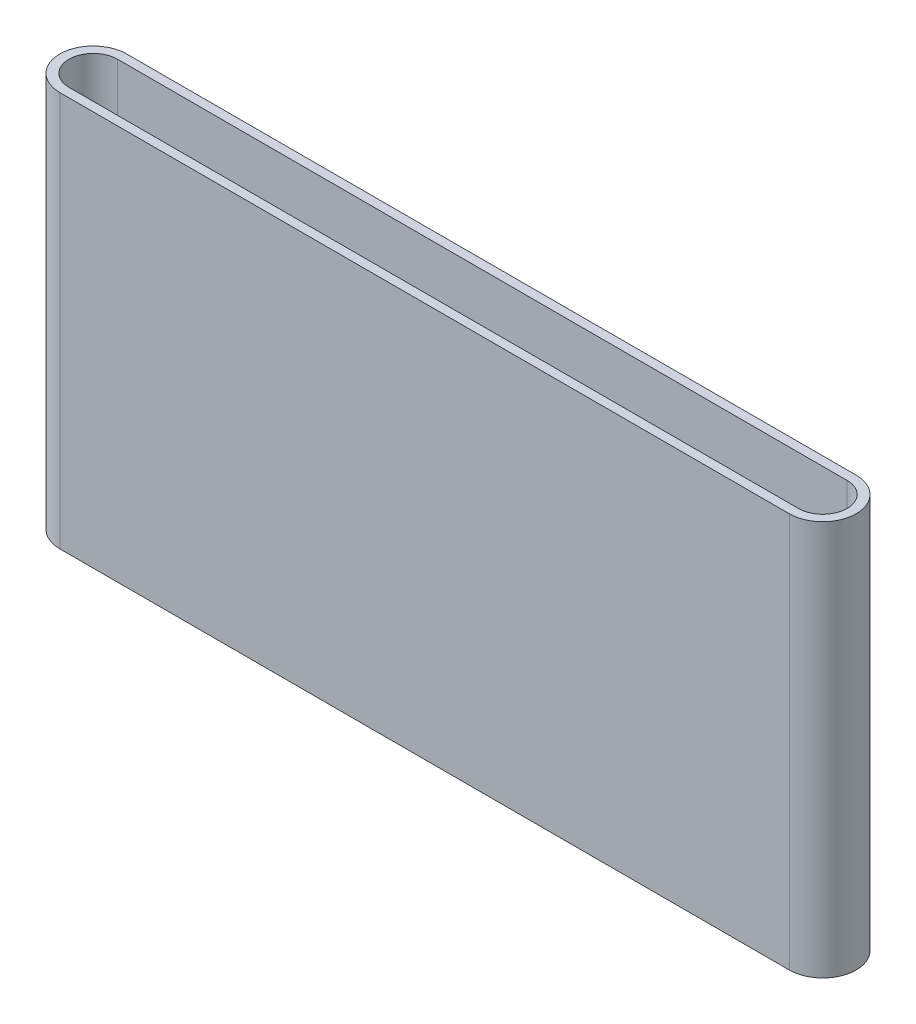
ISO-10303-21;
HEADER;
FILE_DESCRIPTION(('STEP AP214'),'2;1');
FILE_NAME('part.step','',(''),(''),'','','');
FILE_SCHEMA(('AUTOMOTIVE_DESIGN { 1 0 10303 214 1 1 1 1 }'));
ENDSEC;
DATA;
#1=APPLICATION_CONTEXT('core data for automotive mechanical design processes');
#2=APPLICATION_PROTOCOL_DEFINITION('international standard','automotive_design',2000,#1);
#3=PRODUCT_CONTEXT('',#1,'mechanical');
#4=PRODUCT('Part','Part','',(#3));
#5=PRODUCT_RELATED_PRODUCT_CATEGORY('part','',(#4));
#6=PRODUCT_DEFINITION_FORMATION('','',#4);
#7=PRODUCT_DEFINITION_CONTEXT('part definition',#1,'design');
#8=PRODUCT_DEFINITION('design','',#6,#7);
#9=PRODUCT_DEFINITION_SHAPE('','',#8);
#10=(LENGTH_UNIT() NAMED_UNIT(*) SI_UNIT(.MILLI.,.METRE.));
#11=(NAMED_UNIT(*) PLANE_ANGLE_UNIT() SI_UNIT($,.RADIAN.));
#12=(NAMED_UNIT(*) SI_UNIT($,.STERADIAN.) SOLID_ANGLE_UNIT());
#13=UNCERTAINTY_MEASURE_WITH_UNIT(LENGTH_MEASURE(1.E-05),#10,'distance_accuracy_value','');
#14=(GEOMETRIC_REPRESENTATION_CONTEXT(3) GLOBAL_UNCERTAINTY_ASSIGNED_CONTEXT((#13)) GLOBAL_UNIT_ASSIGNED_CONTEXT((#10,
#11,#12)) REPRESENTATION_CONTEXT('',''));
#15=CARTESIAN_POINT('',(0.,0.,0.));
#16=DIRECTION('',(0.,0.,1.));
#17=DIRECTION('',(1.,0.,0.));
#18=AXIS2_PLACEMENT_3D('',#15,#16,#17);
#19=CARTESIAN_POINT('',(0.,65.,0.));
#20=DIRECTION('',(0.,1.,0.));
#21=DIRECTION('',(0.,0.,1.));
#22=AXIS2_PLACEMENT_3D('',#19,#20,#21);
#23=PLANE('',#22);
#24=CARTESIAN_POINT('',(0.,65.,0.));
#25=DIRECTION('',(0.,1.,0.));
#26=DIRECTION('',(0.,0.,1.));
#27=AXIS2_PLACEMENT_3D('',#24,#25,#26);
#28=CIRCLE('',#27,5.5);
#29=CARTESIAN_POINT('',(0.,65.,-5.5));
#30=VERTEX_POINT('',#29);
#31=CARTESIAN_POINT('',(0.,65.,5.5));
#32=VERTEX_POINT('',#31);
#33=EDGE_CURVE('E143',#30,#32,#28,.T.);
#34=ORIENTED_EDGE('',*,*,#33,.T.);
#35=DIRECTION('',(1.,0.,0.));
#36=VECTOR('',#35,1.);
#37=CARTESIAN_POINT('',(0.,65.,5.5));
#38=LINE('',#37,#36);
#39=CARTESIAN_POINT('',(120.,65.,5.5));
#40=VERTEX_POINT('',#39);
#41=EDGE_CURVE('E146',#32,#40,#38,.T.);
#42=ORIENTED_EDGE('',*,*,#41,.T.);
#43=CARTESIAN_POINT('',(120.,65.,0.));
#44=DIRECTION('',(0.,1.,0.));
#45=DIRECTION('',(0.,0.,1.));
#46=AXIS2_PLACEMENT_3D('',#43,#44,#45);
#47=CIRCLE('',#46,5.5);
#48=CARTESIAN_POINT('',(120.,65.,-5.5));
#49=VERTEX_POINT('',#48);
#50=EDGE_CURVE('E149',#40,#49,#47,.T.);
#51=ORIENTED_EDGE('',*,*,#50,.T.);
#52=DIRECTION('',(-1.,0.,0.));
#53=VECTOR('',#52,1.);
#54=CARTESIAN_POINT('',(0.,65.,-5.5));
#55=LINE('',#54,#53);
#56=EDGE_CURVE('E151',#49,#30,#55,.T.);
#57=ORIENTED_EDGE('',*,*,#56,.T.);
#58=EDGE_LOOP('',(#34,#42,#51,#57));
#59=FACE_BOUND('',#58,.T.);
#60=DIRECTION('',(1.,0.,0.));
#61=VECTOR('',#60,1.);
#62=CARTESIAN_POINT('',(0.,65.,4.));
#63=LINE('',#62,#61);
#64=CARTESIAN_POINT('',(0.,65.,4.));
#65=VERTEX_POINT('',#64);
#66=CARTESIAN_POINT('',(120.,65.,4.00000000000001));
#67=VERTEX_POINT('',#66);
#68=EDGE_CURVE('E115',#65,#67,#63,.T.);
#69=ORIENTED_EDGE('',*,*,#68,.F.);
#70=CARTESIAN_POINT('',(0.,65.,0.));
#71=DIRECTION('',(0.,1.,0.));
#72=DIRECTION('',(0.,0.,1.));
#73=AXIS2_PLACEMENT_3D('',#70,#71,#72);
#74=CIRCLE('',#73,4.);
#75=CARTESIAN_POINT('',(0.,65.,-4.));
#76=VERTEX_POINT('',#75);
#77=EDGE_CURVE('E107',#76,#65,#74,.T.);
#78=ORIENTED_EDGE('',*,*,#77,.F.);
#79=DIRECTION('',(-1.,0.,0.));
#80=VECTOR('',#79,1.);
#81=CARTESIAN_POINT('',(0.,65.,-4.));
#82=LINE('',#81,#80);
#83=CARTESIAN_POINT('',(120.,65.,-4.00000000000001));
#84=VERTEX_POINT('',#83);
#85=EDGE_CURVE('E129',#84,#76,#82,.T.);
#86=ORIENTED_EDGE('',*,*,#85,.F.);
#87=CARTESIAN_POINT('',(120.,65.,0.));
#88=DIRECTION('',(0.,1.,0.));
#89=DIRECTION('',(0.,0.,1.));
#90=AXIS2_PLACEMENT_3D('',#87,#88,#89);
#91=CIRCLE('',#90,4.00000000000001);
#92=EDGE_CURVE('E127',#67,#84,#91,.T.);
#93=ORIENTED_EDGE('',*,*,#92,.F.);
#94=EDGE_LOOP('',(#69,#78,#86,#93));
#95=FACE_BOUND('',#94,.T.);
#96=ADVANCED_FACE('F42',(#59,#95),#23,.T.);
#97=CARTESIAN_POINT('',(0.,0.,0.));
#98=DIRECTION('',(0.,1.,0.));
#99=DIRECTION('',(0.,0.,1.));
#100=AXIS2_PLACEMENT_3D('',#97,#98,#99);
#101=PLANE('',#100);
#102=CARTESIAN_POINT('',(0.,0.,0.));
#103=DIRECTION('',(0.,1.,0.));
#104=DIRECTION('',(0.,0.,1.));
#105=AXIS2_PLACEMENT_3D('',#102,#103,#104);
#106=CIRCLE('',#105,5.5);
#107=CARTESIAN_POINT('',(0.,0.,-5.5));
#108=VERTEX_POINT('',#107);
#109=CARTESIAN_POINT('',(0.,0.,5.5));
#110=VERTEX_POINT('',#109);
#111=EDGE_CURVE('E123',#108,#110,#106,.T.);
#112=ORIENTED_EDGE('',*,*,#111,.F.);
#113=DIRECTION('',(-1.,0.,0.));
#114=VECTOR('',#113,1.);
#115=CARTESIAN_POINT('',(0.,0.,-5.5));
#116=LINE('',#115,#114);
#117=CARTESIAN_POINT('',(120.,0.,-5.5));
#118=VERTEX_POINT('',#117);
#119=EDGE_CURVE('E147',#118,#108,#116,.T.);
#120=ORIENTED_EDGE('',*,*,#119,.F.);
#121=CARTESIAN_POINT('',(120.,0.,0.));
#122=DIRECTION('',(0.,1.,0.));
#123=DIRECTION('',(0.,0.,1.));
#124=AXIS2_PLACEMENT_3D('',#121,#122,#123);
#125=CIRCLE('',#124,5.5);
#126=CARTESIAN_POINT('',(120.,0.,5.5));
#127=VERTEX_POINT('',#126);
#128=EDGE_CURVE('E158',#127,#118,#125,.T.);
#129=ORIENTED_EDGE('',*,*,#128,.F.);
#130=DIRECTION('',(1.,0.,0.));
#131=VECTOR('',#130,1.);
#132=CARTESIAN_POINT('',(0.,0.,5.5));
#133=LINE('',#132,#131);
#134=EDGE_CURVE('E156',#110,#127,#133,.T.);
#135=ORIENTED_EDGE('',*,*,#134,.F.);
#136=EDGE_LOOP('',(#112,#120,#129,#135));
#137=FACE_BOUND('',#136,.T.);
#138=CARTESIAN_POINT('',(0.,0.,0.));
#139=DIRECTION('',(0.,1.,0.));
#140=DIRECTION('',(0.,0.,1.));
#141=AXIS2_PLACEMENT_3D('',#138,#139,#140);
#142=CIRCLE('',#141,4.);
#143=CARTESIAN_POINT('',(0.,0.,-4.));
#144=VERTEX_POINT('',#143);
#145=CARTESIAN_POINT('',(0.,0.,4.));
#146=VERTEX_POINT('',#145);
#147=EDGE_CURVE('E65',#144,#146,#142,.T.);
#148=ORIENTED_EDGE('',*,*,#147,.T.);
#149=DIRECTION('',(1.,0.,0.));
#150=VECTOR('',#149,1.);
#151=CARTESIAN_POINT('',(0.,0.,4.));
#152=LINE('',#151,#150);
#153=CARTESIAN_POINT('',(120.,0.,4.00000000000001));
#154=VERTEX_POINT('',#153);
#155=EDGE_CURVE('E122',#146,#154,#152,.T.);
#156=ORIENTED_EDGE('',*,*,#155,.T.);
#157=CARTESIAN_POINT('',(120.,0.,0.));
#158=DIRECTION('',(0.,1.,0.));
#159=DIRECTION('',(0.,0.,1.));
#160=AXIS2_PLACEMENT_3D('',#157,#158,#159);
#161=CIRCLE('',#160,4.00000000000001);
#162=CARTESIAN_POINT('',(120.,0.,-4.00000000000001));
#163=VERTEX_POINT('',#162);
#164=EDGE_CURVE('E135',#154,#163,#161,.T.);
#165=ORIENTED_EDGE('',*,*,#164,.T.);
#166=DIRECTION('',(-1.,0.,0.));
#167=VECTOR('',#166,1.);
#168=CARTESIAN_POINT('',(0.,0.,-4.));
#169=LINE('',#168,#167);
#170=EDGE_CURVE('E116',#163,#144,#169,.T.);
#171=ORIENTED_EDGE('',*,*,#170,.T.);
#172=EDGE_LOOP('',(#148,#156,#165,#171));
#173=FACE_BOUND('',#172,.T.);
#174=ADVANCED_FACE('F176',(#137,#173),#101,.F.);
#175=CARTESIAN_POINT('',(0.,65.,0.));
#176=DIRECTION('',(0.,-1.,0.));
#177=DIRECTION('',(0.,0.,-1.));
#178=AXIS2_PLACEMENT_3D('',#175,#176,#177);
#179=CYLINDRICAL_SURFACE('',#178,5.5);
#180=ORIENTED_EDGE('',*,*,#111,.T.);
#181=DIRECTION('',(0.,-1.,0.));
#182=VECTOR('',#181,1.);
#183=CARTESIAN_POINT('',(0.,65.,5.5));
#184=LINE('',#183,#182);
#185=EDGE_CURVE('E13',#32,#110,#184,.T.);
#186=ORIENTED_EDGE('',*,*,#185,.F.);
#187=ORIENTED_EDGE('',*,*,#33,.F.);
#188=DIRECTION('',(0.,-1.,0.));
#189=VECTOR('',#188,1.);
#190=CARTESIAN_POINT('',(0.,65.,-5.5));
#191=LINE('',#190,#189);
#192=EDGE_CURVE('E153',#30,#108,#191,.T.);
#193=ORIENTED_EDGE('',*,*,#192,.T.);
#194=EDGE_LOOP('',(#180,#186,#187,#193));
#195=FACE_BOUND('',#194,.T.);
#196=ADVANCED_FACE('F44',(#195),#179,.T.);
#197=CARTESIAN_POINT('',(0.,65.,5.5));
#198=DIRECTION('',(0.,0.,-1.));
#199=DIRECTION('',(-1.,0.,0.));
#200=AXIS2_PLACEMENT_3D('',#197,#198,#199);
#201=PLANE('',#200);
#202=ORIENTED_EDGE('',*,*,#134,.T.);
#203=DIRECTION('',(0.,-1.,0.));
#204=VECTOR('',#203,1.);
#205=CARTESIAN_POINT('',(120.,65.,5.5));
#206=LINE('',#205,#204);
#207=EDGE_CURVE('E50',#40,#127,#206,.T.);
#208=ORIENTED_EDGE('',*,*,#207,.F.);
#209=ORIENTED_EDGE('',*,*,#41,.F.);
#210=ORIENTED_EDGE('',*,*,#185,.T.);
#211=EDGE_LOOP('',(#202,#208,#209,#210));
#212=FACE_BOUND('',#211,.T.);
#213=ADVANCED_FACE('F186',(#212),#201,.F.);
#214=CARTESIAN_POINT('',(120.,65.,0.));
#215=DIRECTION('',(0.,-1.,0.));
#216=DIRECTION('',(0.,0.,-1.));
#217=AXIS2_PLACEMENT_3D('',#214,#215,#216);
#218=CYLINDRICAL_SURFACE('',#217,5.5);
#219=ORIENTED_EDGE('',*,*,#128,.T.);
#220=DIRECTION('',(0.,-1.,0.));
#221=VECTOR('',#220,1.);
#222=CARTESIAN_POINT('',(120.,65.,-5.5));
#223=LINE('',#222,#221);
#224=EDGE_CURVE('E163',#49,#118,#223,.T.);
#225=ORIENTED_EDGE('',*,*,#224,.F.);
#226=ORIENTED_EDGE('',*,*,#50,.F.);
#227=ORIENTED_EDGE('',*,*,#207,.T.);
#228=EDGE_LOOP('',(#219,#225,#226,#227));
#229=FACE_BOUND('',#228,.T.);
#230=ADVANCED_FACE('F170',(#229),#218,.T.);
#231=CARTESIAN_POINT('',(0.,65.,-5.5));
#232=DIRECTION('',(0.,0.,1.));
#233=DIRECTION('',(1.,0.,0.));
#234=AXIS2_PLACEMENT_3D('',#231,#232,#233);
#235=PLANE('',#234);
#236=ORIENTED_EDGE('',*,*,#119,.T.);
#237=ORIENTED_EDGE('',*,*,#192,.F.);
#238=ORIENTED_EDGE('',*,*,#56,.F.);
#239=ORIENTED_EDGE('',*,*,#224,.T.);
#240=EDGE_LOOP('',(#236,#237,#238,#239));
#241=FACE_BOUND('',#240,.T.);
#242=ADVANCED_FACE('F180',(#241),#235,.F.);
#243=CARTESIAN_POINT('',(0.,65.,0.));
#244=DIRECTION('',(0.,-1.,0.));
#245=DIRECTION('',(0.,0.,-1.));
#246=AXIS2_PLACEMENT_3D('',#243,#244,#245);
#247=CYLINDRICAL_SURFACE('',#246,4.);
#248=ORIENTED_EDGE('',*,*,#147,.F.);
#249=DIRECTION('',(0.,-1.,0.));
#250=VECTOR('',#249,1.);
#251=CARTESIAN_POINT('',(0.,65.,-4.));
#252=LINE('',#251,#250);
#253=EDGE_CURVE('E111',#76,#144,#252,.T.);
#254=ORIENTED_EDGE('',*,*,#253,.F.);
#255=ORIENTED_EDGE('',*,*,#77,.T.);
#256=DIRECTION('',(0.,-1.,0.));
#257=VECTOR('',#256,1.);
#258=CARTESIAN_POINT('',(0.,65.,4.));
#259=LINE('',#258,#257);
#260=EDGE_CURVE('E110',#65,#146,#259,.T.);
#261=ORIENTED_EDGE('',*,*,#260,.T.);
#262=EDGE_LOOP('',(#248,#254,#255,#261));
#263=FACE_BOUND('',#262,.T.);
#264=ADVANCED_FACE('F109',(#263),#247,.F.);
#265=CARTESIAN_POINT('',(0.,65.,4.));
#266=DIRECTION('',(0.,0.,-1.));
#267=DIRECTION('',(-1.,0.,0.));
#268=AXIS2_PLACEMENT_3D('',#265,#266,#267);
#269=PLANE('',#268);
#270=ORIENTED_EDGE('',*,*,#155,.F.);
#271=ORIENTED_EDGE('',*,*,#260,.F.);
#272=ORIENTED_EDGE('',*,*,#68,.T.);
#273=DIRECTION('',(0.,-1.,0.));
#274=VECTOR('',#273,1.);
#275=CARTESIAN_POINT('',(120.,65.,4.00000000000001));
#276=LINE('',#275,#274);
#277=EDGE_CURVE('E124',#67,#154,#276,.T.);
#278=ORIENTED_EDGE('',*,*,#277,.T.);
#279=EDGE_LOOP('',(#270,#271,#272,#278));
#280=FACE_BOUND('',#279,.T.);
#281=ADVANCED_FACE('F119',(#280),#269,.T.);
#282=CARTESIAN_POINT('',(120.,65.,0.));
#283=DIRECTION('',(0.,-1.,0.));
#284=DIRECTION('',(0.,0.,-1.));
#285=AXIS2_PLACEMENT_3D('',#282,#283,#284);
#286=CYLINDRICAL_SURFACE('',#285,4.00000000000001);
#287=ORIENTED_EDGE('',*,*,#164,.F.);
#288=ORIENTED_EDGE('',*,*,#277,.F.);
#289=ORIENTED_EDGE('',*,*,#92,.T.);
#290=DIRECTION('',(0.,-1.,0.));
#291=VECTOR('',#290,1.);
#292=CARTESIAN_POINT('',(120.,65.,-4.00000000000001));
#293=LINE('',#292,#291);
#294=EDGE_CURVE('E57',#84,#163,#293,.T.);
#295=ORIENTED_EDGE('',*,*,#294,.T.);
#296=EDGE_LOOP('',(#287,#288,#289,#295));
#297=FACE_BOUND('',#296,.T.);
#298=ADVANCED_FACE('F209',(#297),#286,.F.);
#299=CARTESIAN_POINT('',(0.,65.,-4.));
#300=DIRECTION('',(0.,0.,1.));
#301=DIRECTION('',(1.,0.,0.));
#302=AXIS2_PLACEMENT_3D('',#299,#300,#301);
#303=PLANE('',#302);
#304=ORIENTED_EDGE('',*,*,#170,.F.);
#305=ORIENTED_EDGE('',*,*,#294,.F.);
#306=ORIENTED_EDGE('',*,*,#85,.T.);
#307=ORIENTED_EDGE('',*,*,#253,.T.);
#308=EDGE_LOOP('',(#304,#305,#306,#307));
#309=FACE_BOUND('',#308,.T.);
#310=ADVANCED_FACE('F213',(#309),#303,.T.);
#311=CLOSED_SHELL('',(#96,#174,#196,#213,#230,#242,#264,#281,#298,#310));
#312=MANIFOLD_SOLID_BREP('B2',#311);
#313=ADVANCED_BREP_SHAPE_REPRESENTATION('',(#18,#312),#14);
#314=SHAPE_DEFINITION_REPRESENTATION(#9,#313);
ENDSEC;
END-ISO-10303-21;
